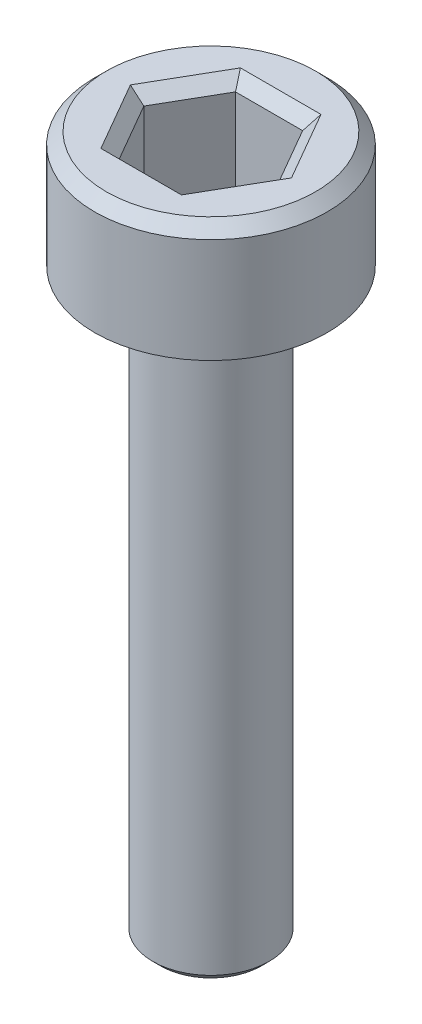
ISO-10303-21;
HEADER;
FILE_DESCRIPTION(('STEP AP214'),'2;1');
FILE_NAME('part.step','',(''),(''),'','','');
FILE_SCHEMA(('AUTOMOTIVE_DESIGN { 1 0 10303 214 1 1 1 1 }'));
ENDSEC;
DATA;
#1=APPLICATION_CONTEXT('core data for automotive mechanical design processes');
#2=APPLICATION_PROTOCOL_DEFINITION('international standard','automotive_design',2000,#1);
#3=PRODUCT_CONTEXT('',#1,'mechanical');
#4=PRODUCT('Part','Part','',(#3));
#5=PRODUCT_RELATED_PRODUCT_CATEGORY('part','',(#4));
#6=PRODUCT_DEFINITION_FORMATION('','',#4);
#7=PRODUCT_DEFINITION_CONTEXT('part definition',#1,'design');
#8=PRODUCT_DEFINITION('design','',#6,#7);
#9=PRODUCT_DEFINITION_SHAPE('','',#8);
#10=(LENGTH_UNIT() NAMED_UNIT(*) SI_UNIT(.MILLI.,.METRE.));
#11=(NAMED_UNIT(*) PLANE_ANGLE_UNIT() SI_UNIT($,.RADIAN.));
#12=(NAMED_UNIT(*) SI_UNIT($,.STERADIAN.) SOLID_ANGLE_UNIT());
#13=UNCERTAINTY_MEASURE_WITH_UNIT(LENGTH_MEASURE(1.E-05),#10,'distance_accuracy_value','');
#14=(GEOMETRIC_REPRESENTATION_CONTEXT(3) GLOBAL_UNCERTAINTY_ASSIGNED_CONTEXT((#13)) GLOBAL_UNIT_ASSIGNED_CONTEXT((#10,
#11,#12)) REPRESENTATION_CONTEXT('',''));
#15=CARTESIAN_POINT('',(0.,0.,0.));
#16=DIRECTION('',(0.,0.,1.));
#17=DIRECTION('',(1.,0.,0.));
#18=AXIS2_PLACEMENT_3D('',#15,#16,#17);
#19=CARTESIAN_POINT('',(0.,0.,0.));
#20=DIRECTION('',(0.,1.,0.));
#21=DIRECTION('',(0.,0.,1.));
#22=AXIS2_PLACEMENT_3D('',#19,#20,#21);
#23=PLANE('',#22);
#24=CARTESIAN_POINT('',(0.,0.,0.));
#25=DIRECTION('',(0.,1.,0.));
#26=DIRECTION('',(0.,0.,1.));
#27=AXIS2_PLACEMENT_3D('',#24,#25,#26);
#28=CIRCLE('',#27,3.);
#29=CARTESIAN_POINT('',(0.,0.,3.));
#30=VERTEX_POINT('',#29);
#31=EDGE_CURVE('E146',#30,#30,#28,.T.);
#32=ORIENTED_EDGE('',*,*,#31,.F.);
#33=EDGE_LOOP('',(#32));
#34=FACE_BOUND('',#33,.T.);
#35=CARTESIAN_POINT('',(0.,0.,0.));
#36=DIRECTION('',(0.,1.,0.));
#37=DIRECTION('',(0.,0.,1.));
#38=AXIS2_PLACEMENT_3D('',#35,#36,#37);
#39=CIRCLE('',#38,1.5);
#40=CARTESIAN_POINT('',(0.,0.,1.5));
#41=VERTEX_POINT('',#40);
#42=EDGE_CURVE('E185',#41,#41,#39,.F.);
#43=ORIENTED_EDGE('',*,*,#42,.F.);
#44=EDGE_LOOP('',(#43));
#45=FACE_BOUND('',#44,.T.);
#46=ADVANCED_FACE('F33',(#34,#45),#23,.F.);
#47=CARTESIAN_POINT('',(0.,3.,0.));
#48=DIRECTION('',(0.,-1.,0.));
#49=DIRECTION('',(0.,0.,-1.));
#50=AXIS2_PLACEMENT_3D('',#47,#48,#49);
#51=CYLINDRICAL_SURFACE('',#50,3.);
#52=CARTESIAN_POINT('',(0.,2.7,0.));
#53=DIRECTION('',(0.,1.,0.));
#54=DIRECTION('',(0.,0.,1.));
#55=AXIS2_PLACEMENT_3D('',#52,#53,#54);
#56=CIRCLE('',#55,3.);
#57=CARTESIAN_POINT('',(0.,2.7,3.));
#58=VERTEX_POINT('',#57);
#59=EDGE_CURVE('E160',#58,#58,#56,.F.);
#60=ORIENTED_EDGE('',*,*,#59,.T.);
#61=EDGE_LOOP('',(#60));
#62=FACE_BOUND('',#61,.T.);
#63=ORIENTED_EDGE('',*,*,#31,.T.);
#64=EDGE_LOOP('',(#63));
#65=FACE_BOUND('',#64,.T.);
#66=ADVANCED_FACE('F213',(#62,#65),#51,.T.);
#67=CARTESIAN_POINT('',(0.,3.,0.));
#68=DIRECTION('',(0.,1.,0.));
#69=DIRECTION('',(0.,0.,1.));
#70=AXIS2_PLACEMENT_3D('',#67,#68,#69);
#71=PLANE('',#70);
#72=DIRECTION('',(1.,0.,0.));
#73=VECTOR('',#72,1.);
#74=CARTESIAN_POINT('',(0.866025403784439,3.,-1.8));
#75=LINE('',#74,#73);
#76=CARTESIAN_POINT('',(-1.03923048454133,3.,-1.8));
#77=VERTEX_POINT('',#76);
#78=CARTESIAN_POINT('',(1.03923048454133,3.,-1.8));
#79=VERTEX_POINT('',#78);
#80=EDGE_CURVE('E165',#77,#79,#75,.T.);
#81=ORIENTED_EDGE('',*,*,#80,.T.);
#82=DIRECTION('',(0.5,0.,0.866025403784439));
#83=VECTOR('',#82,1.);
#84=CARTESIAN_POINT('',(1.99185842870421,3.,-0.150000000000001));
#85=LINE('',#84,#83);
#86=CARTESIAN_POINT('',(2.07846096908265,3.,0.));
#87=VERTEX_POINT('',#86);
#88=EDGE_CURVE('E175',#79,#87,#85,.T.);
#89=ORIENTED_EDGE('',*,*,#88,.T.);
#90=DIRECTION('',(-0.5,0.,0.866025403784439));
#91=VECTOR('',#90,1.);
#92=CARTESIAN_POINT('',(1.12583302491977,3.,1.65));
#93=LINE('',#92,#91);
#94=CARTESIAN_POINT('',(1.03923048454133,3.,1.8));
#95=VERTEX_POINT('',#94);
#96=EDGE_CURVE('E173',#87,#95,#93,.T.);
#97=ORIENTED_EDGE('',*,*,#96,.T.);
#98=DIRECTION('',(-1.,0.,0.));
#99=VECTOR('',#98,1.);
#100=CARTESIAN_POINT('',(-0.866025403784438,3.,1.8));
#101=LINE('',#100,#99);
#102=CARTESIAN_POINT('',(-1.03923048454133,3.,1.8));
#103=VERTEX_POINT('',#102);
#104=EDGE_CURVE('E171',#95,#103,#101,.T.);
#105=ORIENTED_EDGE('',*,*,#104,.T.);
#106=DIRECTION('',(-0.5,0.,-0.866025403784439));
#107=VECTOR('',#106,1.);
#108=CARTESIAN_POINT('',(-1.99185842870421,3.,0.150000000000001));
#109=LINE('',#108,#107);
#110=CARTESIAN_POINT('',(-2.07846096908265,3.,0.));
#111=VERTEX_POINT('',#110);
#112=EDGE_CURVE('E169',#103,#111,#109,.T.);
#113=ORIENTED_EDGE('',*,*,#112,.T.);
#114=DIRECTION('',(0.5,0.,-0.866025403784439));
#115=VECTOR('',#114,1.);
#116=CARTESIAN_POINT('',(-1.12583302491977,3.,-1.65));
#117=LINE('',#116,#115);
#118=EDGE_CURVE('E167',#111,#77,#117,.T.);
#119=ORIENTED_EDGE('',*,*,#118,.T.);
#120=EDGE_LOOP('',(#81,#89,#97,#105,#113,#119));
#121=FACE_BOUND('',#120,.T.);
#122=CARTESIAN_POINT('',(0.,3.,0.));
#123=DIRECTION('',(0.,1.,0.));
#124=DIRECTION('',(0.,0.,1.));
#125=AXIS2_PLACEMENT_3D('',#122,#123,#124);
#126=CIRCLE('',#125,2.7);
#127=CARTESIAN_POINT('',(0.,3.,2.7));
#128=VERTEX_POINT('',#127);
#129=EDGE_CURVE('E157',#128,#128,#126,.T.);
#130=ORIENTED_EDGE('',*,*,#129,.T.);
#131=EDGE_LOOP('',(#130));
#132=FACE_BOUND('',#131,.T.);
#133=ADVANCED_FACE('F219',(#121,#132),#71,.T.);
#134=CARTESIAN_POINT('',(0.,3.,0.));
#135=DIRECTION('',(0.,-1.,0.));
#136=DIRECTION('',(0.,0.,-1.));
#137=AXIS2_PLACEMENT_3D('',#134,#135,#136);
#138=CONICAL_SURFACE('',#137,2.7,0.785398163397448);
#139=ORIENTED_EDGE('',*,*,#59,.F.);
#140=EDGE_LOOP('',(#139));
#141=FACE_BOUND('',#140,.T.);
#142=ORIENTED_EDGE('',*,*,#129,.F.);
#143=EDGE_LOOP('',(#142));
#144=FACE_BOUND('',#143,.T.);
#145=ADVANCED_FACE('F227',(#141,#144),#138,.T.);
#146=CARTESIAN_POINT('',(0.866025403784439,0.5,1.5));
#147=DIRECTION('',(0.866025403784439,0.,0.5));
#148=DIRECTION('',(0.5,0.,-0.866025403784439));
#149=AXIS2_PLACEMENT_3D('',#146,#147,#148);
#150=PLANE('',#149);
#151=DIRECTION('',(0.,1.,0.));
#152=VECTOR('',#151,1.);
#153=CARTESIAN_POINT('',(0.866025403784439,0.5,1.5));
#154=LINE('',#153,#152);
#155=CARTESIAN_POINT('',(0.866025403784439,0.5,1.5));
#156=VERTEX_POINT('',#155);
#157=CARTESIAN_POINT('',(0.866025403784439,2.7,1.5));
#158=VERTEX_POINT('',#157);
#159=EDGE_CURVE('E144',#156,#158,#154,.T.);
#160=ORIENTED_EDGE('',*,*,#159,.T.);
#161=DIRECTION('',(0.5,0.,-0.866025403784439));
#162=VECTOR('',#161,1.);
#163=CARTESIAN_POINT('',(1.73205080756888,2.7,0.));
#164=LINE('',#163,#162);
#165=CARTESIAN_POINT('',(1.73205080756888,2.7,0.));
#166=VERTEX_POINT('',#165);
#167=EDGE_CURVE('E113',#158,#166,#164,.T.);
#168=ORIENTED_EDGE('',*,*,#167,.T.);
#169=DIRECTION('',(0.,1.,0.));
#170=VECTOR('',#169,1.);
#171=CARTESIAN_POINT('',(1.73205080756888,0.5,0.));
#172=LINE('',#171,#170);
#173=CARTESIAN_POINT('',(1.73205080756888,0.5,0.));
#174=VERTEX_POINT('',#173);
#175=EDGE_CURVE('E105',#174,#166,#172,.T.);
#176=ORIENTED_EDGE('',*,*,#175,.F.);
#177=DIRECTION('',(0.5,0.,-0.866025403784439));
#178=VECTOR('',#177,1.);
#179=CARTESIAN_POINT('',(0.866025403784439,0.5,1.5));
#180=LINE('',#179,#178);
#181=EDGE_CURVE('E110',#156,#174,#180,.T.);
#182=ORIENTED_EDGE('',*,*,#181,.F.);
#183=EDGE_LOOP('',(#160,#168,#176,#182));
#184=FACE_BOUND('',#183,.T.);
#185=ADVANCED_FACE('F108',(#184),#150,.F.);
#186=CARTESIAN_POINT('',(-0.866025403784438,0.5,1.5));
#187=DIRECTION('',(0.,0.,1.));
#188=DIRECTION('',(1.,0.,0.));
#189=AXIS2_PLACEMENT_3D('',#186,#187,#188);
#190=PLANE('',#189);
#191=DIRECTION('',(0.,1.,0.));
#192=VECTOR('',#191,1.);
#193=CARTESIAN_POINT('',(-0.866025403784438,0.5,1.5));
#194=LINE('',#193,#192);
#195=CARTESIAN_POINT('',(-0.866025403784438,0.5,1.5));
#196=VERTEX_POINT('',#195);
#197=CARTESIAN_POINT('',(-0.866025403784438,2.7,1.5));
#198=VERTEX_POINT('',#197);
#199=EDGE_CURVE('E147',#196,#198,#194,.T.);
#200=ORIENTED_EDGE('',*,*,#199,.T.);
#201=DIRECTION('',(1.,0.,0.));
#202=VECTOR('',#201,1.);
#203=CARTESIAN_POINT('',(0.866025403784439,2.7,1.5));
#204=LINE('',#203,#202);
#205=EDGE_CURVE('E179',#198,#158,#204,.T.);
#206=ORIENTED_EDGE('',*,*,#205,.T.);
#207=ORIENTED_EDGE('',*,*,#159,.F.);
#208=DIRECTION('',(1.,0.,0.));
#209=VECTOR('',#208,1.);
#210=CARTESIAN_POINT('',(-0.866025403784438,0.5,1.5));
#211=LINE('',#210,#209);
#212=EDGE_CURVE('E118',#196,#156,#211,.T.);
#213=ORIENTED_EDGE('',*,*,#212,.F.);
#214=EDGE_LOOP('',(#200,#206,#207,#213));
#215=FACE_BOUND('',#214,.T.);
#216=ADVANCED_FACE('F280',(#215),#190,.F.);
#217=CARTESIAN_POINT('',(-1.73205080756888,0.5,0.));
#218=DIRECTION('',(-0.866025403784438,0.,0.5));
#219=DIRECTION('',(0.5,0.,0.866025403784439));
#220=AXIS2_PLACEMENT_3D('',#217,#218,#219);
#221=PLANE('',#220);
#222=DIRECTION('',(0.,1.,0.));
#223=VECTOR('',#222,1.);
#224=CARTESIAN_POINT('',(-1.73205080756888,0.5,0.));
#225=LINE('',#224,#223);
#226=CARTESIAN_POINT('',(-1.73205080756888,0.5,0.));
#227=VERTEX_POINT('',#226);
#228=CARTESIAN_POINT('',(-1.73205080756888,2.7,0.));
#229=VERTEX_POINT('',#228);
#230=EDGE_CURVE('E150',#227,#229,#225,.T.);
#231=ORIENTED_EDGE('',*,*,#230,.T.);
#232=DIRECTION('',(0.5,0.,0.866025403784439));
#233=VECTOR('',#232,1.);
#234=CARTESIAN_POINT('',(-0.866025403784438,2.7,1.5));
#235=LINE('',#234,#233);
#236=EDGE_CURVE('E181',#229,#198,#235,.T.);
#237=ORIENTED_EDGE('',*,*,#236,.T.);
#238=ORIENTED_EDGE('',*,*,#199,.F.);
#239=DIRECTION('',(0.5,0.,0.866025403784439));
#240=VECTOR('',#239,1.);
#241=CARTESIAN_POINT('',(-1.73205080756888,0.5,0.));
#242=LINE('',#241,#240);
#243=EDGE_CURVE('E141',#227,#196,#242,.T.);
#244=ORIENTED_EDGE('',*,*,#243,.F.);
#245=EDGE_LOOP('',(#231,#237,#238,#244));
#246=FACE_BOUND('',#245,.T.);
#247=ADVANCED_FACE('F278',(#246),#221,.F.);
#248=CARTESIAN_POINT('',(-0.866025403784438,0.5,-1.5));
#249=DIRECTION('',(-0.866025403784439,0.,-0.5));
#250=DIRECTION('',(-0.5,0.,0.866025403784439));
#251=AXIS2_PLACEMENT_3D('',#248,#249,#250);
#252=PLANE('',#251);
#253=DIRECTION('',(0.,1.,0.));
#254=VECTOR('',#253,1.);
#255=CARTESIAN_POINT('',(-0.866025403784438,0.5,-1.5));
#256=LINE('',#255,#254);
#257=CARTESIAN_POINT('',(-0.866025403784438,0.5,-1.5));
#258=VERTEX_POINT('',#257);
#259=CARTESIAN_POINT('',(-0.866025403784438,2.7,-1.5));
#260=VERTEX_POINT('',#259);
#261=EDGE_CURVE('E152',#258,#260,#256,.T.);
#262=ORIENTED_EDGE('',*,*,#261,.T.);
#263=DIRECTION('',(-0.5,0.,0.866025403784439));
#264=VECTOR('',#263,1.);
#265=CARTESIAN_POINT('',(-1.73205080756888,2.7,0.));
#266=LINE('',#265,#264);
#267=EDGE_CURVE('E55',#260,#229,#266,.T.);
#268=ORIENTED_EDGE('',*,*,#267,.T.);
#269=ORIENTED_EDGE('',*,*,#230,.F.);
#270=DIRECTION('',(-0.5,0.,0.866025403784439));
#271=VECTOR('',#270,1.);
#272=CARTESIAN_POINT('',(-0.866025403784438,0.5,-1.5));
#273=LINE('',#272,#271);
#274=EDGE_CURVE('E138',#258,#227,#273,.T.);
#275=ORIENTED_EDGE('',*,*,#274,.F.);
#276=EDGE_LOOP('',(#262,#268,#269,#275));
#277=FACE_BOUND('',#276,.T.);
#278=ADVANCED_FACE('F276',(#277),#252,.F.);
#279=CARTESIAN_POINT('',(0.866025403784439,0.5,-1.5));
#280=DIRECTION('',(0.,0.,-1.));
#281=DIRECTION('',(-1.,0.,0.));
#282=AXIS2_PLACEMENT_3D('',#279,#280,#281);
#283=PLANE('',#282);
#284=DIRECTION('',(0.,1.,0.));
#285=VECTOR('',#284,1.);
#286=CARTESIAN_POINT('',(0.866025403784439,0.5,-1.5));
#287=LINE('',#286,#285);
#288=CARTESIAN_POINT('',(0.866025403784439,0.5,-1.5));
#289=VERTEX_POINT('',#288);
#290=CARTESIAN_POINT('',(0.866025403784439,2.7,-1.5));
#291=VERTEX_POINT('',#290);
#292=EDGE_CURVE('E117',#289,#291,#287,.T.);
#293=ORIENTED_EDGE('',*,*,#292,.T.);
#294=DIRECTION('',(-1.,0.,0.));
#295=VECTOR('',#294,1.);
#296=CARTESIAN_POINT('',(-0.866025403784438,2.7,-1.5));
#297=LINE('',#296,#295);
#298=EDGE_CURVE('E48',#291,#260,#297,.T.);
#299=ORIENTED_EDGE('',*,*,#298,.T.);
#300=ORIENTED_EDGE('',*,*,#261,.F.);
#301=DIRECTION('',(-1.,0.,0.));
#302=VECTOR('',#301,1.);
#303=CARTESIAN_POINT('',(0.866025403784439,0.5,-1.5));
#304=LINE('',#303,#302);
#305=EDGE_CURVE('E126',#289,#258,#304,.T.);
#306=ORIENTED_EDGE('',*,*,#305,.F.);
#307=EDGE_LOOP('',(#293,#299,#300,#306));
#308=FACE_BOUND('',#307,.T.);
#309=ADVANCED_FACE('F273',(#308),#283,.F.);
#310=CARTESIAN_POINT('',(1.73205080756888,0.5,0.));
#311=DIRECTION('',(0.866025403784438,0.,-0.5));
#312=DIRECTION('',(-0.5,0.,-0.866025403784438));
#313=AXIS2_PLACEMENT_3D('',#310,#311,#312);
#314=PLANE('',#313);
#315=ORIENTED_EDGE('',*,*,#175,.T.);
#316=DIRECTION('',(-0.5,0.,-0.866025403784438));
#317=VECTOR('',#316,1.);
#318=CARTESIAN_POINT('',(0.866025403784439,2.7,-1.5));
#319=LINE('',#318,#317);
#320=EDGE_CURVE('E163',#166,#291,#319,.T.);
#321=ORIENTED_EDGE('',*,*,#320,.T.);
#322=ORIENTED_EDGE('',*,*,#292,.F.);
#323=DIRECTION('',(-0.5,0.,-0.866025403784438));
#324=VECTOR('',#323,1.);
#325=CARTESIAN_POINT('',(1.73205080756888,0.5,0.));
#326=LINE('',#325,#324);
#327=EDGE_CURVE('E121',#174,#289,#326,.T.);
#328=ORIENTED_EDGE('',*,*,#327,.F.);
#329=EDGE_LOOP('',(#315,#321,#322,#328));
#330=FACE_BOUND('',#329,.T.);
#331=ADVANCED_FACE('F122',(#330),#314,.F.);
#332=CARTESIAN_POINT('',(0.,0.5,0.));
#333=DIRECTION('',(0.,1.,0.));
#334=DIRECTION('',(0.,0.,1.));
#335=AXIS2_PLACEMENT_3D('',#332,#333,#334);
#336=PLANE('',#335);
#337=ORIENTED_EDGE('',*,*,#181,.T.);
#338=ORIENTED_EDGE('',*,*,#327,.T.);
#339=ORIENTED_EDGE('',*,*,#305,.T.);
#340=ORIENTED_EDGE('',*,*,#274,.T.);
#341=ORIENTED_EDGE('',*,*,#243,.T.);
#342=ORIENTED_EDGE('',*,*,#212,.T.);
#343=EDGE_LOOP('',(#337,#338,#339,#340,#341,#342));
#344=FACE_BOUND('',#343,.T.);
#345=ADVANCED_FACE('F128',(#344),#336,.T.);
#346=CARTESIAN_POINT('',(-1.73205080756888,2.7,0.));
#347=DIRECTION('',(0.612372435695794,0.707106781186548,-0.353553390593273));
#348=DIRECTION('',(-0.5,0.,-0.866025403784439));
#349=AXIS2_PLACEMENT_3D('',#346,#347,#348);
#350=PLANE('',#349);
#351=DIRECTION('',(0.755928946018455,-0.654653670707976,0.));
#352=VECTOR('',#351,1.);
#353=CARTESIAN_POINT('',(-1.73205080756888,2.7,0.));
#354=LINE('',#353,#352);
#355=EDGE_CURVE('E134',#111,#229,#354,.T.);
#356=ORIENTED_EDGE('',*,*,#355,.F.);
#357=ORIENTED_EDGE('',*,*,#112,.F.);
#358=DIRECTION('',(0.377964473009228,-0.654653670707976,-0.654653670707978));
#359=VECTOR('',#358,1.);
#360=CARTESIAN_POINT('',(-0.866025403784438,2.7,1.5));
#361=LINE('',#360,#359);
#362=EDGE_CURVE('E131',#198,#103,#361,.F.);
#363=ORIENTED_EDGE('',*,*,#362,.F.);
#364=ORIENTED_EDGE('',*,*,#236,.F.);
#365=EDGE_LOOP('',(#356,#357,#363,#364));
#366=FACE_BOUND('',#365,.T.);
#367=ADVANCED_FACE('F249',(#366),#350,.T.);
#368=CARTESIAN_POINT('',(-0.866025403784438,2.7,1.5));
#369=DIRECTION('',(0.,0.707106781186548,-0.707106781186547));
#370=DIRECTION('',(-1.,0.,0.));
#371=AXIS2_PLACEMENT_3D('',#368,#369,#370);
#372=PLANE('',#371);
#373=ORIENTED_EDGE('',*,*,#362,.T.);
#374=ORIENTED_EDGE('',*,*,#104,.F.);
#375=DIRECTION('',(-0.377964473009228,-0.654653670707976,-0.654653670707978));
#376=VECTOR('',#375,1.);
#377=CARTESIAN_POINT('',(0.866025403784439,2.7,1.5));
#378=LINE('',#377,#376);
#379=EDGE_CURVE('E193',#158,#95,#378,.F.);
#380=ORIENTED_EDGE('',*,*,#379,.F.);
#381=ORIENTED_EDGE('',*,*,#205,.F.);
#382=EDGE_LOOP('',(#373,#374,#380,#381));
#383=FACE_BOUND('',#382,.T.);
#384=ADVANCED_FACE('F246',(#383),#372,.T.);
#385=CARTESIAN_POINT('',(-0.866025403784438,2.7,-1.5));
#386=DIRECTION('',(0.612372435695794,0.707106781186549,0.353553390593273));
#387=DIRECTION('',(0.5,0.,-0.866025403784439));
#388=AXIS2_PLACEMENT_3D('',#385,#386,#387);
#389=PLANE('',#388);
#390=ORIENTED_EDGE('',*,*,#355,.T.);
#391=ORIENTED_EDGE('',*,*,#267,.F.);
#392=DIRECTION('',(0.377964473009228,-0.654653670707976,0.654653670707978));
#393=VECTOR('',#392,1.);
#394=CARTESIAN_POINT('',(-0.866025403784438,2.7,-1.5));
#395=LINE('',#394,#393);
#396=EDGE_CURVE('E190',#77,#260,#395,.T.);
#397=ORIENTED_EDGE('',*,*,#396,.F.);
#398=ORIENTED_EDGE('',*,*,#118,.F.);
#399=EDGE_LOOP('',(#390,#391,#397,#398));
#400=FACE_BOUND('',#399,.T.);
#401=ADVANCED_FACE('F242',(#400),#389,.T.);
#402=CARTESIAN_POINT('',(0.866025403784439,2.7,1.5));
#403=DIRECTION('',(-0.612372435695794,0.707106781186549,-0.353553390593273));
#404=DIRECTION('',(-0.5,0.,0.866025403784439));
#405=AXIS2_PLACEMENT_3D('',#402,#403,#404);
#406=PLANE('',#405);
#407=ORIENTED_EDGE('',*,*,#379,.T.);
#408=ORIENTED_EDGE('',*,*,#96,.F.);
#409=DIRECTION('',(-0.755928946018455,-0.654653670707976,0.));
#410=VECTOR('',#409,1.);
#411=CARTESIAN_POINT('',(1.73205080756888,2.7,0.));
#412=LINE('',#411,#410);
#413=EDGE_CURVE('E188',#166,#87,#412,.F.);
#414=ORIENTED_EDGE('',*,*,#413,.F.);
#415=ORIENTED_EDGE('',*,*,#167,.F.);
#416=EDGE_LOOP('',(#407,#408,#414,#415));
#417=FACE_BOUND('',#416,.T.);
#418=ADVANCED_FACE('F238',(#417),#406,.T.);
#419=CARTESIAN_POINT('',(0.866025403784439,2.7,-1.5));
#420=DIRECTION('',(0.,0.707106781186549,0.707106781186547));
#421=DIRECTION('',(1.,0.,0.));
#422=AXIS2_PLACEMENT_3D('',#419,#420,#421);
#423=PLANE('',#422);
#424=ORIENTED_EDGE('',*,*,#396,.T.);
#425=ORIENTED_EDGE('',*,*,#298,.F.);
#426=DIRECTION('',(0.377964473009228,0.654653670707976,-0.654653670707978));
#427=VECTOR('',#426,1.);
#428=CARTESIAN_POINT('',(0.618589574131741,2.27142857142857,-1.07142857142857));
#429=LINE('',#428,#427);
#430=EDGE_CURVE('E186',#79,#291,#429,.F.);
#431=ORIENTED_EDGE('',*,*,#430,.F.);
#432=ORIENTED_EDGE('',*,*,#80,.F.);
#433=EDGE_LOOP('',(#424,#425,#431,#432));
#434=FACE_BOUND('',#433,.T.);
#435=ADVANCED_FACE('F234',(#434),#423,.T.);
#436=CARTESIAN_POINT('',(1.73205080756888,2.7,0.));
#437=DIRECTION('',(-0.612372435695793,0.707106781186549,0.353553390593273));
#438=DIRECTION('',(0.5,0.,0.866025403784438));
#439=AXIS2_PLACEMENT_3D('',#436,#437,#438);
#440=PLANE('',#439);
#441=ORIENTED_EDGE('',*,*,#413,.T.);
#442=ORIENTED_EDGE('',*,*,#88,.F.);
#443=ORIENTED_EDGE('',*,*,#430,.T.);
#444=ORIENTED_EDGE('',*,*,#320,.F.);
#445=EDGE_LOOP('',(#441,#442,#443,#444));
#446=FACE_BOUND('',#445,.T.);
#447=ADVANCED_FACE('F231',(#446),#440,.T.);
#448=CARTESIAN_POINT('',(0.,-15.,0.));
#449=DIRECTION('',(0.,1.,0.));
#450=DIRECTION('',(0.,0.,1.));
#451=AXIS2_PLACEMENT_3D('',#448,#449,#450);
#452=CYLINDRICAL_SURFACE('',#451,1.5);
#453=CARTESIAN_POINT('',(0.,-14.8,0.));
#454=DIRECTION('',(0.,-1.,0.));
#455=DIRECTION('',(0.,0.,-1.));
#456=AXIS2_PLACEMENT_3D('',#453,#454,#455);
#457=CIRCLE('',#456,1.5);
#458=CARTESIAN_POINT('',(0.,-14.8,-1.5));
#459=VERTEX_POINT('',#458);
#460=EDGE_CURVE('E11',#459,#459,#457,.F.);
#461=ORIENTED_EDGE('',*,*,#460,.T.);
#462=EDGE_LOOP('',(#461));
#463=FACE_BOUND('',#462,.T.);
#464=ORIENTED_EDGE('',*,*,#42,.T.);
#465=EDGE_LOOP('',(#464));
#466=FACE_BOUND('',#465,.T.);
#467=ADVANCED_FACE('F209',(#463,#466),#452,.T.);
#468=CARTESIAN_POINT('',(0.,-15.,0.));
#469=DIRECTION('',(0.,-1.,0.));
#470=DIRECTION('',(0.,0.,-1.));
#471=AXIS2_PLACEMENT_3D('',#468,#469,#470);
#472=PLANE('',#471);
#473=CARTESIAN_POINT('',(0.,-15.,0.));
#474=DIRECTION('',(0.,-1.,0.));
#475=DIRECTION('',(0.,0.,-1.));
#476=AXIS2_PLACEMENT_3D('',#473,#474,#475);
#477=CIRCLE('',#476,1.3);
#478=CARTESIAN_POINT('',(0.,-15.,-1.3));
#479=VERTEX_POINT('',#478);
#480=EDGE_CURVE('E41',#479,#479,#477,.T.);
#481=ORIENTED_EDGE('',*,*,#480,.T.);
#482=EDGE_LOOP('',(#481));
#483=FACE_BOUND('',#482,.T.);
#484=ADVANCED_FACE('F202',(#483),#472,.T.);
#485=CARTESIAN_POINT('',(0.,-15.,0.));
#486=DIRECTION('',(0.,1.,0.));
#487=DIRECTION('',(0.,0.,1.));
#488=AXIS2_PLACEMENT_3D('',#485,#486,#487);
#489=CONICAL_SURFACE('',#488,1.3,0.785398163397446);
#490=ORIENTED_EDGE('',*,*,#460,.F.);
#491=EDGE_LOOP('',(#490));
#492=FACE_BOUND('',#491,.T.);
#493=ORIENTED_EDGE('',*,*,#480,.F.);
#494=EDGE_LOOP('',(#493));
#495=FACE_BOUND('',#494,.T.);
#496=ADVANCED_FACE('F35',(#492,#495),#489,.T.);
#497=CLOSED_SHELL('',(#46,#66,#133,#145,#185,#216,#247,#278,#309,#331,#345,#367,#384,#401,#418,
#435,#447,#467,#484,#496));
#498=MANIFOLD_SOLID_BREP('B2',#497);
#499=ADVANCED_BREP_SHAPE_REPRESENTATION('',(#18,#498),#14);
#500=SHAPE_DEFINITION_REPRESENTATION(#9,#499);
ENDSEC;
END-ISO-10303-21;
